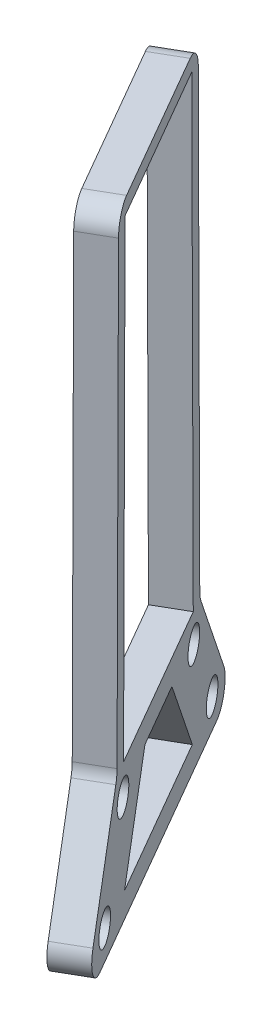
ISO-10303-21;
HEADER;
FILE_DESCRIPTION(('STEP AP214'),'2;1');
FILE_NAME('part.step','',(''),(''),'','','');
FILE_SCHEMA(('AUTOMOTIVE_DESIGN { 1 0 10303 214 1 1 1 1 }'));
ENDSEC;
DATA;
#1=APPLICATION_CONTEXT('core data for automotive mechanical design processes');
#2=APPLICATION_PROTOCOL_DEFINITION('international standard','automotive_design',2000,#1);
#3=PRODUCT_CONTEXT('',#1,'mechanical');
#4=PRODUCT('Part','Part','',(#3));
#5=PRODUCT_RELATED_PRODUCT_CATEGORY('part','',(#4));
#6=PRODUCT_DEFINITION_FORMATION('','',#4);
#7=PRODUCT_DEFINITION_CONTEXT('part definition',#1,'design');
#8=PRODUCT_DEFINITION('design','',#6,#7);
#9=PRODUCT_DEFINITION_SHAPE('','',#8);
#10=(LENGTH_UNIT() NAMED_UNIT(*) SI_UNIT(.MILLI.,.METRE.));
#11=(NAMED_UNIT(*) PLANE_ANGLE_UNIT() SI_UNIT($,.RADIAN.));
#12=(NAMED_UNIT(*) SI_UNIT($,.STERADIAN.) SOLID_ANGLE_UNIT());
#13=UNCERTAINTY_MEASURE_WITH_UNIT(LENGTH_MEASURE(1.E-05),#10,'distance_accuracy_value','');
#14=(GEOMETRIC_REPRESENTATION_CONTEXT(3) GLOBAL_UNCERTAINTY_ASSIGNED_CONTEXT((#13)) GLOBAL_UNIT_ASSIGNED_CONTEXT((#10,
#11,#12)) REPRESENTATION_CONTEXT('',''));
#15=CARTESIAN_POINT('',(0.,0.,0.));
#16=DIRECTION('',(0.,0.,1.));
#17=DIRECTION('',(1.,0.,0.));
#18=AXIS2_PLACEMENT_3D('',#15,#16,#17);
#19=CARTESIAN_POINT('',(50.5492767937711,58.6766333578549,78.2780018098604));
#20=DIRECTION('',(0.422952584681653,0.533333333333332,0.732575365861197));
#21=DIRECTION('',(0.,-0.808446613530097,0.588569514222167));
#22=AXIS2_PLACEMENT_3D('',#19,#20,#21);
#23=PLANE('',#22);
#24=DIRECTION('',(0.266666666666667,-0.845905169363302,0.461880215351699));
#25=VECTOR('',#24,1.);
#26=CARTESIAN_POINT('',(54.4030898406118,58.6766333578549,76.0530018098603));
#27=LINE('',#26,#25);
#28=CARTESIAN_POINT('',(30.8383622259264,133.427351747482,35.2376963147039));
#29=VERTEX_POINT('',#28);
#30=CARTESIAN_POINT('',(34.621292175874,121.427351747482,41.7899231894873));
#31=VERTEX_POINT('',#30);
#32=EDGE_CURVE('E282',#29,#31,#27,.T.);
#33=ORIENTED_EDGE('',*,*,#32,.T.);
#34=DIRECTION('',(0.866025403784438,0.,-0.500000000000002));
#35=VECTOR('',#34,1.);
#36=CARTESIAN_POINT('',(30.7674791290333,121.427351747482,44.0149231894873));
#37=LINE('',#36,#35);
#38=CARTESIAN_POINT('',(30.7674791290333,121.427351747482,44.0149231894873));
#39=VERTEX_POINT('',#38);
#40=EDGE_CURVE('E299',#39,#31,#37,.T.);
#41=ORIENTED_EDGE('',*,*,#40,.F.);
#42=DIRECTION('',(0.266666666666667,-0.845905169363302,0.461880215351699));
#43=VECTOR('',#42,1.);
#44=CARTESIAN_POINT('',(50.5492767937711,58.6766333578549,78.2780018098604));
#45=LINE('',#44,#43);
#46=CARTESIAN_POINT('',(26.9845491790856,133.427351747482,37.4626963147039));
#47=VERTEX_POINT('',#46);
#48=EDGE_CURVE('E233',#47,#39,#45,.T.);
#49=ORIENTED_EDGE('',*,*,#48,.F.);
#50=DIRECTION('',(0.866025403784438,0.,-0.500000000000002));
#51=VECTOR('',#50,1.);
#52=CARTESIAN_POINT('',(26.9845491790856,133.427351747482,37.4626963147039));
#53=LINE('',#52,#51);
#54=EDGE_CURVE('E187',#47,#29,#53,.T.);
#55=ORIENTED_EDGE('',*,*,#54,.T.);
#56=EDGE_LOOP('',(#33,#41,#49,#55));
#57=FACE_BOUND('',#56,.T.);
#58=ADVANCED_FACE('F39',(#57),#23,.F.);
#59=CARTESIAN_POINT('',(4.01658853291651,121.427351747482,-2.31897847070325));
#60=DIRECTION('',(0.,-1.,0.));
#61=DIRECTION('',(1.,0.,0.));
#62=AXIS2_PLACEMENT_3D('',#59,#60,#61);
#63=PLANE('',#62);
#64=DIRECTION('',(-0.500000000000002,0.,-0.866025403784438));
#65=VECTOR('',#64,1.);
#66=CARTESIAN_POINT('',(7.87040157975726,121.427351747482,-4.54397847070326));
#67=LINE('',#66,#65);
#68=CARTESIAN_POINT('',(22.0554322759786,121.427351747482,20.0252154020761));
#69=VERTEX_POINT('',#68);
#70=EDGE_CURVE('E285',#31,#69,#67,.T.);
#71=ORIENTED_EDGE('',*,*,#70,.T.);
#72=DIRECTION('',(0.866025403784438,0.,-0.500000000000002));
#73=VECTOR('',#72,1.);
#74=CARTESIAN_POINT('',(18.2016192291378,121.427351747482,22.2502154020761));
#75=LINE('',#74,#73);
#76=CARTESIAN_POINT('',(18.2016192291378,121.427351747482,22.2502154020761));
#77=VERTEX_POINT('',#76);
#78=EDGE_CURVE('E296',#77,#69,#75,.T.);
#79=ORIENTED_EDGE('',*,*,#78,.F.);
#80=DIRECTION('',(-0.500000000000002,0.,-0.866025403784438));
#81=VECTOR('',#80,1.);
#82=CARTESIAN_POINT('',(4.01658853291651,121.427351747482,-2.31897847070325));
#83=LINE('',#82,#81);
#84=EDGE_CURVE('E236',#39,#77,#83,.T.);
#85=ORIENTED_EDGE('',*,*,#84,.F.);
#86=ORIENTED_EDGE('',*,*,#40,.T.);
#87=EDGE_LOOP('',(#71,#79,#85,#86));
#88=FACE_BOUND('',#87,.T.);
#89=ADVANCED_FACE('F413',(#88),#63,.F.);
#90=CARTESIAN_POINT('',(-13.2241738254208,21.7401987617617,-32.1808548365643));
#91=DIRECTION('',(-0.422952584681651,0.533333333333337,-0.732575365861194));
#92=DIRECTION('',(0.,0.808446613530094,0.588569514222172));
#93=AXIS2_PLACEMENT_3D('',#90,#91,#92);
#94=PLANE('',#93);
#95=DIRECTION('',(0.26666666666667,0.845905169363299,0.461880215351703));
#96=VECTOR('',#95,1.);
#97=CARTESIAN_POINT('',(-9.37036077858006,21.7401987617617,-34.4058548365643));
#98=LINE('',#97,#96);
#99=CARTESIAN_POINT('',(25.8383622259263,133.427351747482,26.5774422768595));
#100=VERTEX_POINT('',#99);
#101=EDGE_CURVE('E287',#69,#100,#98,.T.);
#102=ORIENTED_EDGE('',*,*,#101,.T.);
#103=DIRECTION('',(0.866025403784438,0.,-0.500000000000002));
#104=VECTOR('',#103,1.);
#105=CARTESIAN_POINT('',(21.9845491790856,133.427351747482,28.8024422768595));
#106=LINE('',#105,#104);
#107=CARTESIAN_POINT('',(21.9845491790856,133.427351747482,28.8024422768595));
#108=VERTEX_POINT('',#107);
#109=EDGE_CURVE('E293',#108,#100,#106,.T.);
#110=ORIENTED_EDGE('',*,*,#109,.F.);
#111=DIRECTION('',(0.26666666666667,0.845905169363299,0.461880215351703));
#112=VECTOR('',#111,1.);
#113=CARTESIAN_POINT('',(-13.2241738254208,21.7401987617617,-32.1808548365643));
#114=LINE('',#113,#112);
#115=EDGE_CURVE('E238',#77,#108,#114,.T.);
#116=ORIENTED_EDGE('',*,*,#115,.F.);
#117=ORIENTED_EDGE('',*,*,#78,.T.);
#118=EDGE_LOOP('',(#102,#110,#116,#117));
#119=FACE_BOUND('',#118,.T.);
#120=ADVANCED_FACE('F419',(#119),#94,.F.);
#121=CARTESIAN_POINT('',(4.0165885329165,118.055853922025,-2.31897847070328));
#122=DIRECTION('',(0.,-1.,0.));
#123=DIRECTION('',(1.,0.,0.));
#124=AXIS2_PLACEMENT_3D('',#121,#122,#123);
#125=PLANE('',#124);
#126=DIRECTION('',(-0.500000000000002,0.,-0.866025403784438));
#127=VECTOR('',#126,1.);
#128=CARTESIAN_POINT('',(7.87040157975725,118.055853922025,-4.54397847070329));
#129=LINE('',#128,#127);
#130=CARTESIAN_POINT('',(39.1930225264348,118.055853922025,49.7083924351632));
#131=VERTEX_POINT('',#130);
#132=CARTESIAN_POINT('',(17.483701925418,118.055853922025,12.1067461564005));
#133=VERTEX_POINT('',#132);
#134=EDGE_CURVE('E264',#131,#133,#129,.T.);
#135=ORIENTED_EDGE('',*,*,#134,.F.);
#136=DIRECTION('',(0.866025403784437,0.,-0.500000000000002));
#137=VECTOR('',#136,1.);
#138=CARTESIAN_POINT('',(35.3392094795941,118.055853922025,51.9333924351632));
#139=LINE('',#138,#137);
#140=CARTESIAN_POINT('',(35.3392094795941,118.055853922025,51.9333924351632));
#141=VERTEX_POINT('',#140);
#142=EDGE_CURVE('E350',#131,#141,#139,.F.);
#143=ORIENTED_EDGE('',*,*,#142,.T.);
#144=DIRECTION('',(-0.500000000000002,0.,-0.866025403784438));
#145=VECTOR('',#144,1.);
#146=CARTESIAN_POINT('',(4.0165885329165,118.055853922025,-2.31897847070328));
#147=LINE('',#146,#145);
#148=CARTESIAN_POINT('',(13.6298888785772,118.055853922025,14.3317461564005));
#149=VERTEX_POINT('',#148);
#150=EDGE_CURVE('E217',#141,#149,#147,.T.);
#151=ORIENTED_EDGE('',*,*,#150,.T.);
#152=DIRECTION('',(0.866025403784438,0.,-0.500000000000002));
#153=VECTOR('',#152,1.);
#154=CARTESIAN_POINT('',(13.6298888785772,118.055853922025,14.3317461564005));
#155=LINE('',#154,#153);
#156=EDGE_CURVE('E347',#149,#133,#155,.T.);
#157=ORIENTED_EDGE('',*,*,#156,.T.);
#158=EDGE_LOOP('',(#135,#143,#151,#157));
#159=FACE_BOUND('',#158,.T.);
#160=ADVANCED_FACE('F400',(#159),#125,.T.);
#161=CARTESIAN_POINT('',(55.0056610837388,64.2960298908533,85.9966858181361));
#162=DIRECTION('',(0.422952584681653,0.533333333333333,0.732575365861196));
#163=DIRECTION('',(0.,-0.808446613530097,0.588569514222168));
#164=AXIS2_PLACEMENT_3D('',#161,#162,#163);
#165=PLANE('',#164);
#166=DIRECTION('',(0.266666666666667,-0.845905169363302,0.4618802153517));
#167=VECTOR('',#166,1.);
#168=CARTESIAN_POINT('',(58.8594741305795,64.2960298908533,83.7716858181361));
#169=LINE('',#168,#167);
#170=CARTESIAN_POINT('',(36.2307483891658,136.077615193727,44.5775831234659));
#171=VERTEX_POINT('',#170);
#172=CARTESIAN_POINT('',(40.4618802804798,122.655853922025,51.9061185327468));
#173=VERTEX_POINT('',#172);
#174=EDGE_CURVE('E267',#171,#173,#169,.T.);
#175=ORIENTED_EDGE('',*,*,#174,.F.);
#176=DIRECTION('',(0.866025403784437,0.,-0.500000000000002));
#177=VECTOR('',#176,1.);
#178=CARTESIAN_POINT('',(32.376935342325,136.077615193727,46.8025831234659));
#179=LINE('',#178,#177);
#180=CARTESIAN_POINT('',(32.376935342325,136.077615193727,46.8025831234659));
#181=VERTEX_POINT('',#180);
#182=EDGE_CURVE('E345',#171,#181,#179,.F.);
#183=ORIENTED_EDGE('',*,*,#182,.T.);
#184=DIRECTION('',(0.266666666666667,-0.845905169363302,0.4618802153517));
#185=VECTOR('',#184,1.);
#186=CARTESIAN_POINT('',(55.0056610837388,64.2960298908533,85.9966858181361));
#187=LINE('',#186,#185);
#188=CARTESIAN_POINT('',(36.6080672336391,122.655853922025,54.1311185327468));
#189=VERTEX_POINT('',#188);
#190=EDGE_CURVE('E220',#181,#189,#187,.T.);
#191=ORIENTED_EDGE('',*,*,#190,.T.);
#192=DIRECTION('',(0.866025403784438,0.,-0.500000000000002));
#193=VECTOR('',#192,1.);
#194=CARTESIAN_POINT('',(36.6080672336391,122.655853922025,54.1311185327468));
#195=LINE('',#194,#193);
#196=EDGE_CURVE('E342',#189,#173,#195,.T.);
#197=ORIENTED_EDGE('',*,*,#196,.T.);
#198=EDGE_LOOP('',(#175,#183,#191,#197));
#199=FACE_BOUND('',#198,.T.);
#200=ADVANCED_FACE('F363',(#199),#165,.T.);
#201=CARTESIAN_POINT('',(32.7442953005111,0.501405797786547,47.4388692357107));
#202=DIRECTION('',(0.499980961532087,0.00872653549840142,0.865992428190711));
#203=DIRECTION('',(0.866025403784438,0.,-0.500000000000002));
#204=AXIS2_PLACEMENT_3D('',#201,#202,#203);
#205=PLANE('',#204);
#206=DIRECTION('',(0.00436326774920049,-0.999961923064171,0.00755740142864245));
#207=VECTOR('',#206,1.);
#208=CARTESIAN_POINT('',(36.5981083473519,0.501405797786545,45.2138692357107));
#209=LINE('',#208,#207);
#210=CARTESIAN_POINT('',(35.7293852285765,199.593024830351,43.709196656282));
#211=VERTEX_POINT('',#210);
#212=CARTESIAN_POINT('',(35.9996632586145,137.651435587232,44.1773319364774));
#213=VERTEX_POINT('',#212);
#214=EDGE_CURVE('E270',#211,#213,#209,.T.);
#215=ORIENTED_EDGE('',*,*,#214,.F.);
#216=DIRECTION('',(0.866025403784438,0.,-0.500000000000002));
#217=VECTOR('',#216,1.);
#218=CARTESIAN_POINT('',(31.8755721817358,199.593024830351,45.934196656282));
#219=LINE('',#218,#217);
#220=CARTESIAN_POINT('',(31.8755721817358,199.593024830351,45.934196656282));
#221=VERTEX_POINT('',#220);
#222=EDGE_CURVE('E323',#211,#221,#219,.F.);
#223=ORIENTED_EDGE('',*,*,#222,.T.);
#224=DIRECTION('',(0.00436326774920049,-0.999961923064171,0.00755740142864245));
#225=VECTOR('',#224,1.);
#226=CARTESIAN_POINT('',(32.7442953005111,0.501405797786547,47.4388692357107));
#227=LINE('',#226,#225);
#228=CARTESIAN_POINT('',(32.1458502117737,137.651435587232,46.4023319364774));
#229=VERTEX_POINT('',#228);
#230=EDGE_CURVE('E223',#221,#229,#227,.T.);
#231=ORIENTED_EDGE('',*,*,#230,.T.);
#232=DIRECTION('',(0.866025403784438,0.,-0.500000000000002));
#233=VECTOR('',#232,1.);
#234=CARTESIAN_POINT('',(35.9996632586145,137.651435587232,44.1773319364774));
#235=LINE('',#234,#233);
#236=EDGE_CURVE('E320',#229,#213,#235,.T.);
#237=ORIENTED_EDGE('',*,*,#236,.T.);
#238=EDGE_LOOP('',(#215,#223,#231,#237));
#239=FACE_BOUND('',#238,.T.);
#240=ADVANCED_FACE('F372',(#239),#205,.T.);
#241=CARTESIAN_POINT('',(4.0165885329165,202.566845223856,-2.31897847070332));
#242=DIRECTION('',(0.,1.,0.));
#243=DIRECTION('',(-1.,0.,0.));
#244=AXIS2_PLACEMENT_3D('',#241,#242,#243);
#245=PLANE('',#244);
#246=DIRECTION('',(0.500000000000002,0.,0.866025403784438));
#247=VECTOR('',#246,1.);
#248=CARTESIAN_POINT('',(4.0165885329165,202.566845223856,-2.31897847070332));
#249=LINE('',#248,#247);
#250=CARTESIAN_POINT('',(18.5934690610303,202.566845223856,22.9289192198511));
#251=VERTEX_POINT('',#250);
#252=CARTESIAN_POINT('',(30.3756292971395,202.566845223856,43.3362193717099));
#253=VERTEX_POINT('',#252);
#254=EDGE_CURVE('E226',#251,#253,#249,.T.);
#255=ORIENTED_EDGE('',*,*,#254,.T.);
#256=DIRECTION('',(0.866025403784438,0.,-0.500000000000002));
#257=VECTOR('',#256,1.);
#258=CARTESIAN_POINT('',(30.3756292971395,202.566845223856,43.3362193717099));
#259=LINE('',#258,#257);
#260=CARTESIAN_POINT('',(34.2294423439803,202.566845223856,41.1112193717099));
#261=VERTEX_POINT('',#260);
#262=EDGE_CURVE('E309',#253,#261,#259,.T.);
#263=ORIENTED_EDGE('',*,*,#262,.T.);
#264=DIRECTION('',(0.500000000000002,0.,0.866025403784438));
#265=VECTOR('',#264,1.);
#266=CARTESIAN_POINT('',(7.87040157975725,202.566845223856,-4.54397847070333));
#267=LINE('',#266,#265);
#268=CARTESIAN_POINT('',(22.447282107871,202.566845223856,20.7039192198511));
#269=VERTEX_POINT('',#268);
#270=EDGE_CURVE('E273',#269,#261,#267,.T.);
#271=ORIENTED_EDGE('',*,*,#270,.F.);
#272=DIRECTION('',(0.866025403784437,0.,-0.500000000000002));
#273=VECTOR('',#272,1.);
#274=CARTESIAN_POINT('',(18.5934690610303,202.566845223856,22.9289192198511));
#275=LINE('',#274,#273);
#276=EDGE_CURVE('E302',#269,#251,#275,.F.);
#277=ORIENTED_EDGE('',*,*,#276,.T.);
#278=EDGE_LOOP('',(#255,#263,#271,#277));
#279=FACE_BOUND('',#278,.T.);
#280=ADVANCED_FACE('F380',(#279),#245,.T.);
#281=CARTESIAN_POINT('',(16.2216856881178,-0.213024538493192,18.8208699134198));
#282=DIRECTION('',(0.499980961532088,-0.0087265354983565,0.865992428190712));
#283=DIRECTION('',(0.866025403784437,0.,-0.500000000000002));
#284=AXIS2_PLACEMENT_3D('',#281,#282,#283);
#285=PLANE('',#284);
#286=DIRECTION('',(-0.00436326774917851,-0.999961923064172,-0.00755740142860328));
#287=VECTOR('',#286,1.);
#288=CARTESIAN_POINT('',(16.2216856881178,-0.213024538493192,18.8208699134198));
#289=LINE('',#288,#287);
#290=CARTESIAN_POINT('',(17.093526176434,199.593024830351,20.3309419352789));
#291=VERTEX_POINT('',#290);
#292=CARTESIAN_POINT('',(16.8232481463975,137.651435587232,19.862806655086));
#293=VERTEX_POINT('',#292);
#294=EDGE_CURVE('E229',#291,#293,#289,.T.);
#295=ORIENTED_EDGE('',*,*,#294,.F.);
#296=DIRECTION('',(0.866025403784438,0.,-0.500000000000002));
#297=VECTOR('',#296,1.);
#298=CARTESIAN_POINT('',(20.9473392232748,199.593024830351,18.1059419352789));
#299=LINE('',#298,#297);
#300=CARTESIAN_POINT('',(20.9473392232748,199.593024830351,18.1059419352789));
#301=VERTEX_POINT('',#300);
#302=EDGE_CURVE('E335',#291,#301,#299,.T.);
#303=ORIENTED_EDGE('',*,*,#302,.T.);
#304=DIRECTION('',(-0.00436326774917851,-0.999961923064172,-0.00755740142860328));
#305=VECTOR('',#304,1.);
#306=CARTESIAN_POINT('',(20.0754987349586,-0.213024538493194,16.5958699134198));
#307=LINE('',#306,#305);
#308=CARTESIAN_POINT('',(20.6770611932382,137.651435587232,17.637806655086));
#309=VERTEX_POINT('',#308);
#310=EDGE_CURVE('E276',#301,#309,#307,.T.);
#311=ORIENTED_EDGE('',*,*,#310,.T.);
#312=DIRECTION('',(0.866025403784437,0.,-0.500000000000002));
#313=VECTOR('',#312,1.);
#314=CARTESIAN_POINT('',(16.8232481463975,137.651435587232,19.862806655086));
#315=LINE('',#314,#313);
#316=EDGE_CURVE('E333',#309,#293,#315,.F.);
#317=ORIENTED_EDGE('',*,*,#316,.T.);
#318=EDGE_LOOP('',(#295,#303,#311,#317));
#319=FACE_BOUND('',#318,.T.);
#320=ADVANCED_FACE('F388',(#319),#285,.F.);
#321=CARTESIAN_POINT('',(4.01658853291649,136.798849572939,-2.31897847070331));
#322=DIRECTION('',(0.,1.,0.));
#323=DIRECTION('',(-1.,0.,0.));
#324=AXIS2_PLACEMENT_3D('',#321,#322,#323);
#325=PLANE('',#324);
#326=DIRECTION('',(0.500000000000002,0.,0.866025403784438));
#327=VECTOR('',#326,1.);
#328=CARTESIAN_POINT('',(7.87040157975723,136.798849572939,-4.54397847070332));
#329=LINE('',#328,#327);
#330=CARTESIAN_POINT('',(21.8806825678347,136.798849572939,19.7225400289631));
#331=VERTEX_POINT('',#330);
#332=CARTESIAN_POINT('',(34.7960418840163,136.798849572939,42.0925985625975));
#333=VERTEX_POINT('',#332);
#334=EDGE_CURVE('E182',#331,#333,#329,.T.);
#335=ORIENTED_EDGE('',*,*,#334,.F.);
#336=DIRECTION('',(0.866025403784438,0.,-0.500000000000002));
#337=VECTOR('',#336,1.);
#338=CARTESIAN_POINT('',(18.026869520994,136.798849572939,21.9475400289631));
#339=LINE('',#338,#337);
#340=CARTESIAN_POINT('',(18.026869520994,136.798849572939,21.9475400289631));
#341=VERTEX_POINT('',#340);
#342=EDGE_CURVE('E177',#341,#331,#339,.T.);
#343=ORIENTED_EDGE('',*,*,#342,.F.);
#344=DIRECTION('',(0.500000000000002,0.,0.866025403784438));
#345=VECTOR('',#344,1.);
#346=CARTESIAN_POINT('',(4.01658853291649,136.798849572939,-2.31897847070331));
#347=LINE('',#346,#345);
#348=CARTESIAN_POINT('',(30.9422288371756,136.798849572939,44.3175985625975));
#349=VERTEX_POINT('',#348);
#350=EDGE_CURVE('E180',#341,#349,#347,.T.);
#351=ORIENTED_EDGE('',*,*,#350,.T.);
#352=DIRECTION('',(0.866025403784438,0.,-0.500000000000002));
#353=VECTOR('',#352,1.);
#354=CARTESIAN_POINT('',(30.9422288371756,136.798849572939,44.3175985625975));
#355=LINE('',#354,#353);
#356=EDGE_CURVE('E242',#349,#333,#355,.T.);
#357=ORIENTED_EDGE('',*,*,#356,.T.);
#358=EDGE_LOOP('',(#335,#343,#351,#357));
#359=FACE_BOUND('',#358,.T.);
#360=ADVANCED_FACE('F179',(#359),#325,.T.);
#361=CARTESIAN_POINT('',(17.4289353234416,-0.234095554409435,20.9118876192196));
#362=DIRECTION('',(0.499980961532088,-0.00872653549837363,0.865992428190712));
#363=DIRECTION('',(0.866025403784437,0.,-0.500000000000002));
#364=AXIS2_PLACEMENT_3D('',#361,#362,#363);
#365=PLANE('',#364);
#366=DIRECTION('',(-0.00436326774918707,-0.999961923064171,-0.00755740142861811));
#367=VECTOR('',#366,1.);
#368=CARTESIAN_POINT('',(21.2827483702824,-0.234095554409436,18.6868876192196));
#369=LINE('',#368,#367);
#370=CARTESIAN_POINT('',(22.1589300014984,200.566845223856,20.2044787211441));
#371=VERTEX_POINT('',#370);
#372=EDGE_CURVE('E247',#371,#331,#369,.T.);
#373=ORIENTED_EDGE('',*,*,#372,.F.);
#374=DIRECTION('',(0.866025403784438,0.,-0.500000000000002));
#375=VECTOR('',#374,1.);
#376=CARTESIAN_POINT('',(18.3051169546576,200.566845223856,22.4294787211441));
#377=LINE('',#376,#375);
#378=CARTESIAN_POINT('',(18.3051169546576,200.566845223856,22.4294787211441));
#379=VERTEX_POINT('',#378);
#380=EDGE_CURVE('E188',#379,#371,#377,.T.);
#381=ORIENTED_EDGE('',*,*,#380,.F.);
#382=DIRECTION('',(-0.00436326774918707,-0.999961923064171,-0.00755740142861811));
#383=VECTOR('',#382,1.);
#384=CARTESIAN_POINT('',(17.4289353234416,-0.234095554409435,20.9118876192196));
#385=LINE('',#384,#383);
#386=EDGE_CURVE('E195',#379,#341,#385,.T.);
#387=ORIENTED_EDGE('',*,*,#386,.T.);
#388=ORIENTED_EDGE('',*,*,#342,.T.);
#389=EDGE_LOOP('',(#373,#381,#387,#388));
#390=FACE_BOUND('',#389,.T.);
#391=ADVANCED_FACE('F200',(#390),#365,.T.);
#392=CARTESIAN_POINT('',(4.0165885329165,200.566845223856,-2.31897847070332));
#393=DIRECTION('',(0.,1.,0.));
#394=DIRECTION('',(-1.,0.,0.));
#395=AXIS2_PLACEMENT_3D('',#392,#393,#394);
#396=PLANE('',#395);
#397=DIRECTION('',(0.500000000000002,0.,0.866025403784438));
#398=VECTOR('',#397,1.);
#399=CARTESIAN_POINT('',(7.87040157975725,200.566845223856,-4.54397847070333));
#400=LINE('',#399,#398);
#401=CARTESIAN_POINT('',(34.5177944503527,200.566845223856,41.6106598704164));
#402=VERTEX_POINT('',#401);
#403=EDGE_CURVE('E249',#371,#402,#400,.T.);
#404=ORIENTED_EDGE('',*,*,#403,.T.);
#405=DIRECTION('',(0.866025403784438,0.,-0.500000000000002));
#406=VECTOR('',#405,1.);
#407=CARTESIAN_POINT('',(30.663981403512,200.566845223856,43.8356598704164));
#408=LINE('',#407,#406);
#409=CARTESIAN_POINT('',(30.663981403512,200.566845223856,43.8356598704164));
#410=VERTEX_POINT('',#409);
#411=EDGE_CURVE('E304',#410,#402,#408,.T.);
#412=ORIENTED_EDGE('',*,*,#411,.F.);
#413=DIRECTION('',(0.500000000000002,0.,0.866025403784438));
#414=VECTOR('',#413,1.);
#415=CARTESIAN_POINT('',(4.0165885329165,200.566845223856,-2.31897847070332));
#416=LINE('',#415,#414);
#417=EDGE_CURVE('E202',#379,#410,#416,.T.);
#418=ORIENTED_EDGE('',*,*,#417,.F.);
#419=ORIENTED_EDGE('',*,*,#380,.T.);
#420=EDGE_LOOP('',(#404,#412,#418,#419));
#421=FACE_BOUND('',#420,.T.);
#422=ADVANCED_FACE('F427',(#421),#396,.F.);
#423=CARTESIAN_POINT('',(-17.6805581153877,27.3595952947579,-39.8995388448387));
#424=DIRECTION('',(-0.422952584681656,0.533333333333321,-0.732575365861203));
#425=DIRECTION('',(0.,0.808446613530106,0.588569514222156));
#426=AXIS2_PLACEMENT_3D('',#423,#424,#425);
#427=PLANE('',#426);
#428=DIRECTION('',(0.266666666666662,0.845905169363309,0.461880215351689));
#429=VECTOR('',#428,1.);
#430=CARTESIAN_POINT('',(-17.6805581153877,27.3595952947579,-39.8995388448387));
#431=LINE('',#430,#429);
#432=CARTESIAN_POINT('',(12.3610311245323,122.655853922025,12.1340200588169));
#433=VERTEX_POINT('',#432);
#434=CARTESIAN_POINT('',(16.5921630158462,136.077615193727,19.4625554680975));
#435=VERTEX_POINT('',#434);
#436=EDGE_CURVE('E231',#433,#435,#431,.T.);
#437=ORIENTED_EDGE('',*,*,#436,.T.);
#438=DIRECTION('',(0.866025403784437,0.,-0.500000000000002));
#439=VECTOR('',#438,1.);
#440=CARTESIAN_POINT('',(16.5921630158462,136.077615193727,19.4625554680975));
#441=LINE('',#440,#439);
#442=CARTESIAN_POINT('',(20.4459760626869,136.077615193727,17.2375554680975));
#443=VERTEX_POINT('',#442);
#444=EDGE_CURVE('E339',#435,#443,#441,.T.);
#445=ORIENTED_EDGE('',*,*,#444,.T.);
#446=DIRECTION('',(0.266666666666662,0.845905169363309,0.461880215351689));
#447=VECTOR('',#446,1.);
#448=CARTESIAN_POINT('',(-13.8267450685469,27.3595952947579,-42.1245388448387));
#449=LINE('',#448,#447);
#450=CARTESIAN_POINT('',(16.214844171373,122.655853922025,9.90902005881687));
#451=VERTEX_POINT('',#450);
#452=EDGE_CURVE('E279',#451,#443,#449,.T.);
#453=ORIENTED_EDGE('',*,*,#452,.F.);
#454=DIRECTION('',(0.866025403784438,0.,-0.500000000000002));
#455=VECTOR('',#454,1.);
#456=CARTESIAN_POINT('',(12.3610311245323,122.655853922025,12.1340200588169));
#457=LINE('',#456,#455);
#458=EDGE_CURVE('E61',#451,#433,#457,.F.);
#459=ORIENTED_EDGE('',*,*,#458,.T.);
#460=EDGE_LOOP('',(#437,#445,#453,#459));
#461=FACE_BOUND('',#460,.T.);
#462=ADVANCED_FACE('F394',(#461),#427,.T.);
#463=CARTESIAN_POINT('',(31.0462158457516,132.798849572942,44.4977093447782));
#464=DIRECTION('',(0.866025403784438,0.,-0.500000000000002));
#465=DIRECTION('',(-0.500000000000002,0.,-0.866025403784438));
#466=AXIS2_PLACEMENT_3D('',#463,#464,#465);
#467=CYLINDRICAL_SURFACE('',#466,2.15000000000001);
#468=CARTESIAN_POINT('',(31.0462158457516,132.798849572942,44.4977093447782));
#469=DIRECTION('',(-0.866025403784437,0.,0.500000000000002));
#470=DIRECTION('',(0.500000000000002,0.,0.866025403784438));
#471=AXIS2_PLACEMENT_3D('',#468,#469,#470);
#472=CIRCLE('',#471,2.15000000000001);
#473=CARTESIAN_POINT('',(32.1212158457516,132.798849572942,46.3596639629148));
#474=VERTEX_POINT('',#473);
#475=EDGE_CURVE('E214',#474,#474,#472,.T.);
#476=ORIENTED_EDGE('',*,*,#475,.T.);
#477=EDGE_LOOP('',(#476));
#478=FACE_BOUND('',#477,.T.);
#479=CARTESIAN_POINT('',(34.9000288925923,132.798849572942,42.2727093447782));
#480=DIRECTION('',(-0.866025403784437,0.,0.500000000000002));
#481=DIRECTION('',(0.500000000000002,0.,0.866025403784438));
#482=AXIS2_PLACEMENT_3D('',#479,#480,#481);
#483=CIRCLE('',#482,2.15000000000001);
#484=CARTESIAN_POINT('',(35.9750288925923,132.798849572942,44.1346639629148));
#485=VERTEX_POINT('',#484);
#486=EDGE_CURVE('E261',#485,#485,#483,.T.);
#487=ORIENTED_EDGE('',*,*,#486,.F.);
#488=EDGE_LOOP('',(#487));
#489=FACE_BOUND('',#488,.T.);
#490=ADVANCED_FACE('F426',(#478,#489),#467,.F.);
#491=CARTESIAN_POINT('',(34.4328825124183,122.055853922028,50.3635880797449));
#492=DIRECTION('',(0.866025403784438,0.,-0.500000000000002));
#493=DIRECTION('',(-0.500000000000002,0.,-0.866025403784438));
#494=AXIS2_PLACEMENT_3D('',#491,#492,#493);
#495=CYLINDRICAL_SURFACE('',#494,2.15000000000001);
#496=CARTESIAN_POINT('',(34.4328825124183,122.055853922028,50.3635880797449));
#497=DIRECTION('',(-0.866025403784437,0.,0.500000000000002));
#498=DIRECTION('',(0.500000000000002,0.,0.866025403784438));
#499=AXIS2_PLACEMENT_3D('',#496,#497,#498);
#500=CIRCLE('',#499,2.15000000000001);
#501=CARTESIAN_POINT('',(35.5078825124183,122.055853922028,52.2255426978814));
#502=VERTEX_POINT('',#501);
#503=EDGE_CURVE('E211',#502,#502,#500,.T.);
#504=ORIENTED_EDGE('',*,*,#503,.T.);
#505=EDGE_LOOP('',(#504));
#506=FACE_BOUND('',#505,.T.);
#507=CARTESIAN_POINT('',(38.286695559259,122.055853922028,48.1385880797448));
#508=DIRECTION('',(-0.866025403784437,0.,0.500000000000002));
#509=DIRECTION('',(0.500000000000002,0.,0.866025403784438));
#510=AXIS2_PLACEMENT_3D('',#507,#508,#509);
#511=CIRCLE('',#510,2.15000000000001);
#512=CARTESIAN_POINT('',(39.361695559259,122.055853922028,50.0005426978814));
#513=VERTEX_POINT('',#512);
#514=EDGE_CURVE('E258',#513,#513,#511,.T.);
#515=ORIENTED_EDGE('',*,*,#514,.F.);
#516=EDGE_LOOP('',(#515));
#517=FACE_BOUND('',#516,.T.);
#518=ADVANCED_FACE('F440',(#506,#517),#495,.F.);
#519=CARTESIAN_POINT('',(14.5362158457522,122.055853922025,15.9015505118173));
#520=DIRECTION('',(0.866025403784438,0.,-0.500000000000002));
#521=DIRECTION('',(-0.500000000000002,0.,-0.866025403784438));
#522=AXIS2_PLACEMENT_3D('',#519,#520,#521);
#523=CYLINDRICAL_SURFACE('',#522,2.14999999999957);
#524=CARTESIAN_POINT('',(14.5362158457522,122.055853922025,15.9015505118173));
#525=DIRECTION('',(-0.866025403784437,0.,0.500000000000002));
#526=DIRECTION('',(0.500000000000002,0.,0.866025403784438));
#527=AXIS2_PLACEMENT_3D('',#524,#525,#526);
#528=CIRCLE('',#527,2.14999999999957);
#529=CARTESIAN_POINT('',(15.611215845752,122.055853922025,17.7635051299535));
#530=VERTEX_POINT('',#529);
#531=EDGE_CURVE('E208',#530,#530,#528,.T.);
#532=ORIENTED_EDGE('',*,*,#531,.T.);
#533=EDGE_LOOP('',(#532));
#534=FACE_BOUND('',#533,.T.);
#535=CARTESIAN_POINT('',(18.3900288925929,122.055853922025,13.6765505118173));
#536=DIRECTION('',(-0.866025403784437,0.,0.500000000000002));
#537=DIRECTION('',(0.500000000000002,0.,0.866025403784438));
#538=AXIS2_PLACEMENT_3D('',#535,#536,#537);
#539=CIRCLE('',#538,2.14999999999957);
#540=CARTESIAN_POINT('',(19.4650288925927,122.055853922025,15.5385051299535));
#541=VERTEX_POINT('',#540);
#542=EDGE_CURVE('E255',#541,#541,#539,.T.);
#543=ORIENTED_EDGE('',*,*,#542,.F.);
#544=EDGE_LOOP('',(#543));
#545=FACE_BOUND('',#544,.T.);
#546=ADVANCED_FACE('F444',(#534,#545),#523,.F.);
#547=CARTESIAN_POINT('',(31.5370456651827,0.480334781869066,45.3478515299028));
#548=DIRECTION('',(0.499980961532087,0.00872653549837403,0.865992428190712));
#549=DIRECTION('',(0.866025403784437,0.,-0.500000000000002));
#550=AXIS2_PLACEMENT_3D('',#547,#548,#549);
#551=PLANE('',#550);
#552=DIRECTION('',(0.00436326774918679,-0.999961923064171,0.00755740142861874));
#553=VECTOR('',#552,1.);
#554=CARTESIAN_POINT('',(35.3908587120234,0.480334781869065,43.1228515299028));
#555=LINE('',#554,#553);
#556=EDGE_CURVE('E252',#402,#333,#555,.T.);
#557=ORIENTED_EDGE('',*,*,#556,.T.);
#558=ORIENTED_EDGE('',*,*,#356,.F.);
#559=DIRECTION('',(0.00436326774918679,-0.999961923064171,0.00755740142861874));
#560=VECTOR('',#559,1.);
#561=CARTESIAN_POINT('',(31.5370456651827,0.480334781869066,45.3478515299028));
#562=LINE('',#561,#560);
#563=EDGE_CURVE('E196',#410,#349,#562,.T.);
#564=ORIENTED_EDGE('',*,*,#563,.F.);
#565=ORIENTED_EDGE('',*,*,#411,.T.);
#566=EDGE_LOOP('',(#557,#558,#564,#565));
#567=FACE_BOUND('',#566,.T.);
#568=ADVANCED_FACE('F448',(#567),#551,.F.);
#569=CARTESIAN_POINT('',(17.9228825124187,132.798849572939,21.7674292467837));
#570=DIRECTION('',(0.866025403784438,0.,-0.500000000000002));
#571=DIRECTION('',(-0.500000000000002,0.,-0.866025403784438));
#572=AXIS2_PLACEMENT_3D('',#569,#570,#571);
#573=CYLINDRICAL_SURFACE('',#572,2.14999999999976);
#574=CARTESIAN_POINT('',(17.9228825124187,132.798849572939,21.7674292467837));
#575=DIRECTION('',(-0.866025403784437,0.,0.500000000000002));
#576=DIRECTION('',(0.500000000000002,0.,0.866025403784438));
#577=AXIS2_PLACEMENT_3D('',#574,#575,#576);
#578=CIRCLE('',#577,2.14999999999976);
#579=CARTESIAN_POINT('',(18.9978825124186,132.798849572939,23.62938386492));
#580=VERTEX_POINT('',#579);
#581=EDGE_CURVE('E198',#580,#580,#578,.T.);
#582=ORIENTED_EDGE('',*,*,#581,.T.);
#583=EDGE_LOOP('',(#582));
#584=FACE_BOUND('',#583,.T.);
#585=CARTESIAN_POINT('',(21.7766955592595,132.798849572939,19.5424292467837));
#586=DIRECTION('',(-0.866025403784437,0.,0.500000000000002));
#587=DIRECTION('',(0.500000000000002,0.,0.866025403784438));
#588=AXIS2_PLACEMENT_3D('',#585,#586,#587);
#589=CIRCLE('',#588,2.14999999999976);
#590=CARTESIAN_POINT('',(22.8516955592594,132.798849572939,21.40438386492));
#591=VERTEX_POINT('',#590);
#592=EDGE_CURVE('E243',#591,#591,#589,.T.);
#593=ORIENTED_EDGE('',*,*,#592,.F.);
#594=EDGE_LOOP('',(#593));
#595=FACE_BOUND('',#594,.T.);
#596=ADVANCED_FACE('F452',(#584,#595),#573,.F.);
#597=CARTESIAN_POINT('',(4.01658853291649,133.427351747482,-2.31897847070331));
#598=DIRECTION('',(0.,1.,0.));
#599=DIRECTION('',(-1.,0.,0.));
#600=AXIS2_PLACEMENT_3D('',#597,#598,#599);
#601=PLANE('',#600);
#602=DIRECTION('',(0.500000000000002,0.,0.866025403784438));
#603=VECTOR('',#602,1.);
#604=CARTESIAN_POINT('',(7.87040157975723,133.427351747482,-4.54397847070332));
#605=LINE('',#604,#603);
#606=EDGE_CURVE('E289',#100,#29,#605,.T.);
#607=ORIENTED_EDGE('',*,*,#606,.T.);
#608=ORIENTED_EDGE('',*,*,#54,.F.);
#609=DIRECTION('',(0.500000000000002,0.,0.866025403784438));
#610=VECTOR('',#609,1.);
#611=CARTESIAN_POINT('',(4.01658853291649,133.427351747482,-2.31897847070331));
#612=LINE('',#611,#610);
#613=EDGE_CURVE('E240',#108,#47,#612,.T.);
#614=ORIENTED_EDGE('',*,*,#613,.F.);
#615=ORIENTED_EDGE('',*,*,#109,.T.);
#616=EDGE_LOOP('',(#607,#608,#614,#615));
#617=FACE_BOUND('',#616,.T.);
#618=ADVANCED_FACE('F463',(#617),#601,.F.);
#619=CARTESIAN_POINT('',(4.01658853291646,0.,-2.31897847070329));
#620=DIRECTION('',(-0.866025403784437,0.,0.500000000000002));
#621=DIRECTION('',(0.500000000000002,0.,0.866025403784438));
#622=AXIS2_PLACEMENT_3D('',#619,#620,#621);
#623=PLANE('',#622);
#624=ORIENTED_EDGE('',*,*,#581,.F.);
#625=EDGE_LOOP('',(#624));
#626=FACE_BOUND('',#625,.T.);
#627=ORIENTED_EDGE('',*,*,#350,.F.);
#628=ORIENTED_EDGE('',*,*,#386,.F.);
#629=ORIENTED_EDGE('',*,*,#417,.T.);
#630=ORIENTED_EDGE('',*,*,#563,.T.);
#631=EDGE_LOOP('',(#627,#628,#629,#630));
#632=FACE_BOUND('',#631,.T.);
#633=ORIENTED_EDGE('',*,*,#531,.F.);
#634=EDGE_LOOP('',(#633));
#635=FACE_BOUND('',#634,.T.);
#636=ORIENTED_EDGE('',*,*,#503,.F.);
#637=EDGE_LOOP('',(#636));
#638=FACE_BOUND('',#637,.T.);
#639=ORIENTED_EDGE('',*,*,#475,.F.);
#640=EDGE_LOOP('',(#639));
#641=FACE_BOUND('',#640,.T.);
#642=ORIENTED_EDGE('',*,*,#230,.F.);
#643=CARTESIAN_POINT('',(30.3756292971395,199.566845223856,43.3362193717099));
#644=DIRECTION('',(-0.866025403784437,0.,0.500000000000002));
#645=DIRECTION('',(0.500000000000002,0.,0.866025403784438));
#646=AXIS2_PLACEMENT_3D('',#643,#644,#645);
#647=CIRCLE('',#646,3.);
#648=EDGE_CURVE('E331',#221,#253,#647,.T.);
#649=ORIENTED_EDGE('',*,*,#648,.T.);
#650=ORIENTED_EDGE('',*,*,#254,.F.);
#651=CARTESIAN_POINT('',(18.5934690610303,199.566845223856,22.9289192198511));
#652=DIRECTION('',(-0.866025403784437,0.,0.500000000000002));
#653=DIRECTION('',(0.500000000000002,0.,0.866025403784438));
#654=AXIS2_PLACEMENT_3D('',#651,#652,#653);
#655=CIRCLE('',#654,3.);
#656=EDGE_CURVE('E329',#251,#291,#655,.T.);
#657=ORIENTED_EDGE('',*,*,#656,.T.);
#658=ORIENTED_EDGE('',*,*,#294,.T.);
#659=CARTESIAN_POINT('',(15.3233052618012,137.677615193727,17.2648293705139));
#660=DIRECTION('',(-0.866025403784437,0.,0.500000000000002));
#661=DIRECTION('',(0.500000000000002,0.,0.866025403784438));
#662=AXIS2_PLACEMENT_3D('',#659,#660,#661);
#663=CIRCLE('',#662,3.);
#664=EDGE_CURVE('E54',#293,#435,#663,.F.);
#665=ORIENTED_EDGE('',*,*,#664,.T.);
#666=ORIENTED_EDGE('',*,*,#436,.F.);
#667=CARTESIAN_POINT('',(13.6298888785772,121.055853922025,14.3317461564005));
#668=DIRECTION('',(-0.866025403784437,0.,0.500000000000002));
#669=DIRECTION('',(0.500000000000002,0.,0.866025403784438));
#670=AXIS2_PLACEMENT_3D('',#667,#668,#669);
#671=CIRCLE('',#670,3.);
#672=EDGE_CURVE('E325',#433,#149,#671,.T.);
#673=ORIENTED_EDGE('',*,*,#672,.T.);
#674=ORIENTED_EDGE('',*,*,#150,.F.);
#675=CARTESIAN_POINT('',(35.3392094795941,121.055853922025,51.9333924351632));
#676=DIRECTION('',(-0.866025403784437,0.,0.500000000000002));
#677=DIRECTION('',(0.500000000000002,0.,0.866025403784438));
#678=AXIS2_PLACEMENT_3D('',#675,#676,#677);
#679=CIRCLE('',#678,3.);
#680=EDGE_CURVE('E327',#141,#189,#679,.T.);
#681=ORIENTED_EDGE('',*,*,#680,.T.);
#682=ORIENTED_EDGE('',*,*,#190,.F.);
#683=CARTESIAN_POINT('',(33.64579309637,137.677615193727,49.0003092210495));
#684=DIRECTION('',(-0.866025403784437,0.,0.500000000000002));
#685=DIRECTION('',(0.500000000000002,0.,0.866025403784438));
#686=AXIS2_PLACEMENT_3D('',#683,#684,#685);
#687=CIRCLE('',#686,3.);
#688=EDGE_CURVE('E11',#181,#229,#687,.F.);
#689=ORIENTED_EDGE('',*,*,#688,.T.);
#690=EDGE_LOOP('',(#642,#649,#650,#657,#658,#665,#666,#673,#674,#681,#682,#689));
#691=FACE_BOUND('',#690,.T.);
#692=ORIENTED_EDGE('',*,*,#48,.T.);
#693=ORIENTED_EDGE('',*,*,#84,.T.);
#694=ORIENTED_EDGE('',*,*,#115,.T.);
#695=ORIENTED_EDGE('',*,*,#613,.T.);
#696=EDGE_LOOP('',(#692,#693,#694,#695));
#697=FACE_BOUND('',#696,.T.);
#698=ADVANCED_FACE('F192',(#626,#632,#635,#638,#641,#691,#697),#623,.T.);
#699=CARTESIAN_POINT('',(7.87040157975721,0.,-4.5439784707033));
#700=DIRECTION('',(-0.866025403784437,0.,0.500000000000002));
#701=DIRECTION('',(0.500000000000002,0.,0.866025403784438));
#702=AXIS2_PLACEMENT_3D('',#699,#700,#701);
#703=PLANE('',#702);
#704=ORIENTED_EDGE('',*,*,#592,.T.);
#705=EDGE_LOOP('',(#704));
#706=FACE_BOUND('',#705,.T.);
#707=ORIENTED_EDGE('',*,*,#334,.T.);
#708=ORIENTED_EDGE('',*,*,#556,.F.);
#709=ORIENTED_EDGE('',*,*,#403,.F.);
#710=ORIENTED_EDGE('',*,*,#372,.T.);
#711=EDGE_LOOP('',(#707,#708,#709,#710));
#712=FACE_BOUND('',#711,.T.);
#713=ORIENTED_EDGE('',*,*,#542,.T.);
#714=EDGE_LOOP('',(#713));
#715=FACE_BOUND('',#714,.T.);
#716=ORIENTED_EDGE('',*,*,#514,.T.);
#717=EDGE_LOOP('',(#716));
#718=FACE_BOUND('',#717,.T.);
#719=ORIENTED_EDGE('',*,*,#486,.T.);
#720=EDGE_LOOP('',(#719));
#721=FACE_BOUND('',#720,.T.);
#722=ORIENTED_EDGE('',*,*,#270,.T.);
#723=CARTESIAN_POINT('',(34.2294423439803,199.566845223856,41.1112193717099));
#724=DIRECTION('',(-0.866025403784437,0.,0.500000000000002));
#725=DIRECTION('',(0.500000000000002,0.,0.866025403784438));
#726=AXIS2_PLACEMENT_3D('',#723,#724,#725);
#727=CIRCLE('',#726,3.);
#728=EDGE_CURVE('E318',#261,#211,#727,.F.);
#729=ORIENTED_EDGE('',*,*,#728,.T.);
#730=ORIENTED_EDGE('',*,*,#214,.T.);
#731=CARTESIAN_POINT('',(37.4996061432107,137.677615193727,46.7753092210495));
#732=DIRECTION('',(-0.866025403784437,0.,0.500000000000002));
#733=DIRECTION('',(0.500000000000002,0.,0.866025403784438));
#734=AXIS2_PLACEMENT_3D('',#731,#732,#733);
#735=CIRCLE('',#734,3.);
#736=EDGE_CURVE('E47',#213,#171,#735,.T.);
#737=ORIENTED_EDGE('',*,*,#736,.T.);
#738=ORIENTED_EDGE('',*,*,#174,.T.);
#739=CARTESIAN_POINT('',(39.1930225264348,121.055853922025,49.7083924351632));
#740=DIRECTION('',(-0.866025403784437,0.,0.500000000000002));
#741=DIRECTION('',(0.500000000000002,0.,0.866025403784438));
#742=AXIS2_PLACEMENT_3D('',#739,#740,#741);
#743=CIRCLE('',#742,3.);
#744=EDGE_CURVE('E314',#173,#131,#743,.F.);
#745=ORIENTED_EDGE('',*,*,#744,.T.);
#746=ORIENTED_EDGE('',*,*,#134,.T.);
#747=CARTESIAN_POINT('',(17.483701925418,121.055853922025,12.1067461564005));
#748=DIRECTION('',(-0.866025403784437,0.,0.500000000000002));
#749=DIRECTION('',(0.500000000000002,0.,0.866025403784438));
#750=AXIS2_PLACEMENT_3D('',#747,#748,#749);
#751=CIRCLE('',#750,3.);
#752=EDGE_CURVE('E312',#133,#451,#751,.F.);
#753=ORIENTED_EDGE('',*,*,#752,.T.);
#754=ORIENTED_EDGE('',*,*,#452,.T.);
#755=CARTESIAN_POINT('',(19.1771183086419,137.677615193727,15.0398293705139));
#756=DIRECTION('',(-0.866025403784437,0.,0.500000000000002));
#757=DIRECTION('',(0.500000000000002,0.,0.866025403784438));
#758=AXIS2_PLACEMENT_3D('',#755,#756,#757);
#759=CIRCLE('',#758,3.);
#760=EDGE_CURVE('E352',#443,#309,#759,.T.);
#761=ORIENTED_EDGE('',*,*,#760,.T.);
#762=ORIENTED_EDGE('',*,*,#310,.F.);
#763=CARTESIAN_POINT('',(22.447282107871,199.566845223856,20.7039192198511));
#764=DIRECTION('',(-0.866025403784437,0.,0.500000000000002));
#765=DIRECTION('',(0.500000000000002,0.,0.866025403784438));
#766=AXIS2_PLACEMENT_3D('',#763,#764,#765);
#767=CIRCLE('',#766,3.);
#768=EDGE_CURVE('E316',#301,#269,#767,.F.);
#769=ORIENTED_EDGE('',*,*,#768,.T.);
#770=EDGE_LOOP('',(#722,#729,#730,#737,#738,#745,#746,#753,#754,#761,#762,#769));
#771=FACE_BOUND('',#770,.T.);
#772=ORIENTED_EDGE('',*,*,#32,.F.);
#773=ORIENTED_EDGE('',*,*,#606,.F.);
#774=ORIENTED_EDGE('',*,*,#101,.F.);
#775=ORIENTED_EDGE('',*,*,#70,.F.);
#776=EDGE_LOOP('',(#772,#773,#774,#775));
#777=FACE_BOUND('',#776,.T.);
#778=ADVANCED_FACE('F356',(#706,#712,#715,#718,#721,#771,#777),#703,.F.);
#779=CARTESIAN_POINT('',(30.3756292971395,199.566845223856,43.3362193717099));
#780=DIRECTION('',(0.866025403784438,0.,-0.500000000000002));
#781=DIRECTION('',(-0.500000000000002,0.,-0.866025403784438));
#782=AXIS2_PLACEMENT_3D('',#779,#780,#781);
#783=CYLINDRICAL_SURFACE('',#782,3.);
#784=ORIENTED_EDGE('',*,*,#648,.F.);
#785=ORIENTED_EDGE('',*,*,#222,.F.);
#786=ORIENTED_EDGE('',*,*,#728,.F.);
#787=ORIENTED_EDGE('',*,*,#262,.F.);
#788=EDGE_LOOP('',(#784,#785,#786,#787));
#789=FACE_BOUND('',#788,.T.);
#790=ADVANCED_FACE('F375',(#789),#783,.T.);
#791=CARTESIAN_POINT('',(18.5934690610303,199.566845223856,22.9289192198511));
#792=DIRECTION('',(-0.866025403784437,0.,0.500000000000002));
#793=DIRECTION('',(0.500000000000002,0.,0.866025403784438));
#794=AXIS2_PLACEMENT_3D('',#791,#792,#793);
#795=CYLINDRICAL_SURFACE('',#794,3.);
#796=ORIENTED_EDGE('',*,*,#656,.F.);
#797=ORIENTED_EDGE('',*,*,#276,.F.);
#798=ORIENTED_EDGE('',*,*,#768,.F.);
#799=ORIENTED_EDGE('',*,*,#302,.F.);
#800=EDGE_LOOP('',(#796,#797,#798,#799));
#801=FACE_BOUND('',#800,.T.);
#802=ADVANCED_FACE('F384',(#801),#795,.T.);
#803=CARTESIAN_POINT('',(15.3233052618012,137.677615193727,17.2648293705139));
#804=DIRECTION('',(0.866025403784438,0.,-0.500000000000002));
#805=DIRECTION('',(-0.500000000000002,0.,-0.866025403784438));
#806=AXIS2_PLACEMENT_3D('',#803,#804,#805);
#807=CYLINDRICAL_SURFACE('',#806,3.);
#808=ORIENTED_EDGE('',*,*,#664,.F.);
#809=ORIENTED_EDGE('',*,*,#316,.F.);
#810=ORIENTED_EDGE('',*,*,#760,.F.);
#811=ORIENTED_EDGE('',*,*,#444,.F.);
#812=EDGE_LOOP('',(#808,#809,#810,#811));
#813=FACE_BOUND('',#812,.T.);
#814=ADVANCED_FACE('F392',(#813),#807,.F.);
#815=CARTESIAN_POINT('',(33.64579309637,137.677615193727,49.0003092210495));
#816=DIRECTION('',(-0.866025403784438,0.,0.500000000000002));
#817=DIRECTION('',(0.500000000000002,0.,0.866025403784438));
#818=AXIS2_PLACEMENT_3D('',#815,#816,#817);
#819=CYLINDRICAL_SURFACE('',#818,3.);
#820=ORIENTED_EDGE('',*,*,#688,.F.);
#821=ORIENTED_EDGE('',*,*,#182,.F.);
#822=ORIENTED_EDGE('',*,*,#736,.F.);
#823=ORIENTED_EDGE('',*,*,#236,.F.);
#824=EDGE_LOOP('',(#820,#821,#822,#823));
#825=FACE_BOUND('',#824,.T.);
#826=ADVANCED_FACE('F367',(#825),#819,.F.);
#827=CARTESIAN_POINT('',(35.3392094795941,121.055853922025,51.9333924351632));
#828=DIRECTION('',(0.866025403784437,0.,-0.500000000000002));
#829=DIRECTION('',(-0.500000000000002,0.,-0.866025403784438));
#830=AXIS2_PLACEMENT_3D('',#827,#828,#829);
#831=CYLINDRICAL_SURFACE('',#830,3.);
#832=ORIENTED_EDGE('',*,*,#680,.F.);
#833=ORIENTED_EDGE('',*,*,#142,.F.);
#834=ORIENTED_EDGE('',*,*,#744,.F.);
#835=ORIENTED_EDGE('',*,*,#196,.F.);
#836=EDGE_LOOP('',(#832,#833,#834,#835));
#837=FACE_BOUND('',#836,.T.);
#838=ADVANCED_FACE('F405',(#837),#831,.T.);
#839=CARTESIAN_POINT('',(13.6298888785772,121.055853922025,14.3317461564005));
#840=DIRECTION('',(0.866025403784438,0.,-0.500000000000002));
#841=DIRECTION('',(-0.500000000000002,0.,-0.866025403784438));
#842=AXIS2_PLACEMENT_3D('',#839,#840,#841);
#843=CYLINDRICAL_SURFACE('',#842,3.);
#844=ORIENTED_EDGE('',*,*,#672,.F.);
#845=ORIENTED_EDGE('',*,*,#458,.F.);
#846=ORIENTED_EDGE('',*,*,#752,.F.);
#847=ORIENTED_EDGE('',*,*,#156,.F.);
#848=EDGE_LOOP('',(#844,#845,#846,#847));
#849=FACE_BOUND('',#848,.T.);
#850=ADVANCED_FACE('F41',(#849),#843,.T.);
#851=CLOSED_SHELL('',(#58,#89,#120,#160,#200,#240,#280,#320,#360,#391,#422,#462,#490,#518,#546,
#568,#596,#618,#698,#778,#790,#802,#814,#826,#838,#850));
#852=MANIFOLD_SOLID_BREP('B2',#851);
#853=ADVANCED_BREP_SHAPE_REPRESENTATION('',(#18,#852),#14);
#854=SHAPE_DEFINITION_REPRESENTATION(#9,#853);
ENDSEC;
END-ISO-10303-21;
